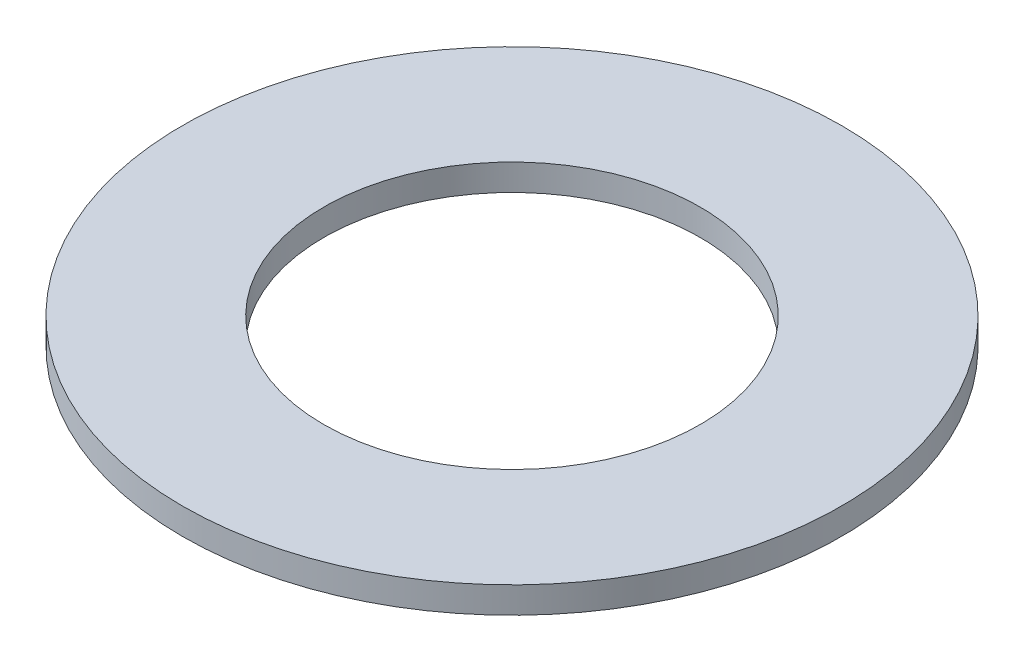
ISO-10303-21;
HEADER;
FILE_DESCRIPTION(('STEP AP214'),'2;1');
FILE_NAME('part.step','',(''),(''),'','','');
FILE_SCHEMA(('AUTOMOTIVE_DESIGN { 1 0 10303 214 1 1 1 1 }'));
ENDSEC;
DATA;
#1=APPLICATION_CONTEXT('core data for automotive mechanical design processes');
#2=APPLICATION_PROTOCOL_DEFINITION('international standard','automotive_design',2000,#1);
#3=PRODUCT_CONTEXT('',#1,'mechanical');
#4=PRODUCT('Part','Part','',(#3));
#5=PRODUCT_RELATED_PRODUCT_CATEGORY('part','',(#4));
#6=PRODUCT_DEFINITION_FORMATION('','',#4);
#7=PRODUCT_DEFINITION_CONTEXT('part definition',#1,'design');
#8=PRODUCT_DEFINITION('design','',#6,#7);
#9=PRODUCT_DEFINITION_SHAPE('','',#8);
#10=(LENGTH_UNIT() NAMED_UNIT(*) SI_UNIT(.MILLI.,.METRE.));
#11=(NAMED_UNIT(*) PLANE_ANGLE_UNIT() SI_UNIT($,.RADIAN.));
#12=(NAMED_UNIT(*) SI_UNIT($,.STERADIAN.) SOLID_ANGLE_UNIT());
#13=UNCERTAINTY_MEASURE_WITH_UNIT(LENGTH_MEASURE(1.E-05),#10,'distance_accuracy_value','');
#14=(GEOMETRIC_REPRESENTATION_CONTEXT(3) GLOBAL_UNCERTAINTY_ASSIGNED_CONTEXT((#13)) GLOBAL_UNIT_ASSIGNED_CONTEXT((#10,
#11,#12)) REPRESENTATION_CONTEXT('',''));
#15=CARTESIAN_POINT('',(0.,0.,0.));
#16=DIRECTION('',(0.,0.,1.));
#17=DIRECTION('',(1.,0.,0.));
#18=AXIS2_PLACEMENT_3D('',#15,#16,#17);
#19=CARTESIAN_POINT('',(0.,7.,0.));
#20=DIRECTION('',(0.,-1.,0.));
#21=DIRECTION('',(0.,0.,-1.));
#22=AXIS2_PLACEMENT_3D('',#19,#20,#21);
#23=CYLINDRICAL_SURFACE('',#22,87.5);
#24=CARTESIAN_POINT('',(0.,7.,0.));
#25=DIRECTION('',(0.,1.,0.));
#26=DIRECTION('',(0.,0.,1.));
#27=AXIS2_PLACEMENT_3D('',#24,#25,#26);
#28=CIRCLE('',#27,87.5);
#29=CARTESIAN_POINT('',(0.,7.,87.5));
#30=VERTEX_POINT('',#29);
#31=EDGE_CURVE('E10',#30,#30,#28,.T.);
#32=ORIENTED_EDGE('',*,*,#31,.F.);
#33=EDGE_LOOP('',(#32));
#34=FACE_BOUND('',#33,.T.);
#35=CARTESIAN_POINT('',(0.,0.,0.));
#36=DIRECTION('',(0.,1.,0.));
#37=DIRECTION('',(0.,0.,1.));
#38=AXIS2_PLACEMENT_3D('',#35,#36,#37);
#39=CIRCLE('',#38,87.5);
#40=CARTESIAN_POINT('',(0.,0.,87.5));
#41=VERTEX_POINT('',#40);
#42=EDGE_CURVE('E37',#41,#41,#39,.T.);
#43=ORIENTED_EDGE('',*,*,#42,.T.);
#44=EDGE_LOOP('',(#43));
#45=FACE_BOUND('',#44,.T.);
#46=ADVANCED_FACE('F40',(#34,#45),#23,.T.);
#47=CARTESIAN_POINT('',(0.,7.,0.));
#48=DIRECTION('',(0.,1.,0.));
#49=DIRECTION('',(0.,0.,1.));
#50=AXIS2_PLACEMENT_3D('',#47,#48,#49);
#51=PLANE('',#50);
#52=CARTESIAN_POINT('',(0.,7.,0.));
#53=DIRECTION('',(0.,1.,0.));
#54=DIRECTION('',(0.,0.,1.));
#55=AXIS2_PLACEMENT_3D('',#52,#53,#54);
#56=CIRCLE('',#55,50.);
#57=CARTESIAN_POINT('',(0.,7.,50.));
#58=VERTEX_POINT('',#57);
#59=EDGE_CURVE('E50',#58,#58,#56,.T.);
#60=ORIENTED_EDGE('',*,*,#59,.F.);
#61=EDGE_LOOP('',(#60));
#62=FACE_BOUND('',#61,.T.);
#63=ORIENTED_EDGE('',*,*,#31,.T.);
#64=EDGE_LOOP('',(#63));
#65=FACE_BOUND('',#64,.T.);
#66=ADVANCED_FACE('F59',(#62,#65),#51,.T.);
#67=CARTESIAN_POINT('',(0.,0.,0.));
#68=DIRECTION('',(0.,1.,0.));
#69=DIRECTION('',(0.,0.,1.));
#70=AXIS2_PLACEMENT_3D('',#67,#68,#69);
#71=PLANE('',#70);
#72=CARTESIAN_POINT('',(0.,0.,0.));
#73=DIRECTION('',(0.,1.,0.));
#74=DIRECTION('',(0.,0.,1.));
#75=AXIS2_PLACEMENT_3D('',#72,#73,#74);
#76=CIRCLE('',#75,50.);
#77=CARTESIAN_POINT('',(0.,0.,50.));
#78=VERTEX_POINT('',#77);
#79=EDGE_CURVE('E47',#78,#78,#76,.T.);
#80=ORIENTED_EDGE('',*,*,#79,.T.);
#81=EDGE_LOOP('',(#80));
#82=FACE_BOUND('',#81,.T.);
#83=ORIENTED_EDGE('',*,*,#42,.F.);
#84=EDGE_LOOP('',(#83));
#85=FACE_BOUND('',#84,.T.);
#86=ADVANCED_FACE('F58',(#82,#85),#71,.F.);
#87=CARTESIAN_POINT('',(0.,7.,0.));
#88=DIRECTION('',(0.,-1.,0.));
#89=DIRECTION('',(0.,0.,-1.));
#90=AXIS2_PLACEMENT_3D('',#87,#88,#89);
#91=CYLINDRICAL_SURFACE('',#90,50.);
#92=ORIENTED_EDGE('',*,*,#59,.T.);
#93=EDGE_LOOP('',(#92));
#94=FACE_BOUND('',#93,.T.);
#95=ORIENTED_EDGE('',*,*,#79,.F.);
#96=EDGE_LOOP('',(#95));
#97=FACE_BOUND('',#96,.T.);
#98=ADVANCED_FACE('F54',(#94,#97),#91,.F.);
#99=CLOSED_SHELL('',(#46,#66,#86,#98));
#100=MANIFOLD_SOLID_BREP('B2',#99);
#101=ADVANCED_BREP_SHAPE_REPRESENTATION('',(#18,#100),#14);
#102=SHAPE_DEFINITION_REPRESENTATION(#9,#101);
ENDSEC;
END-ISO-10303-21;
